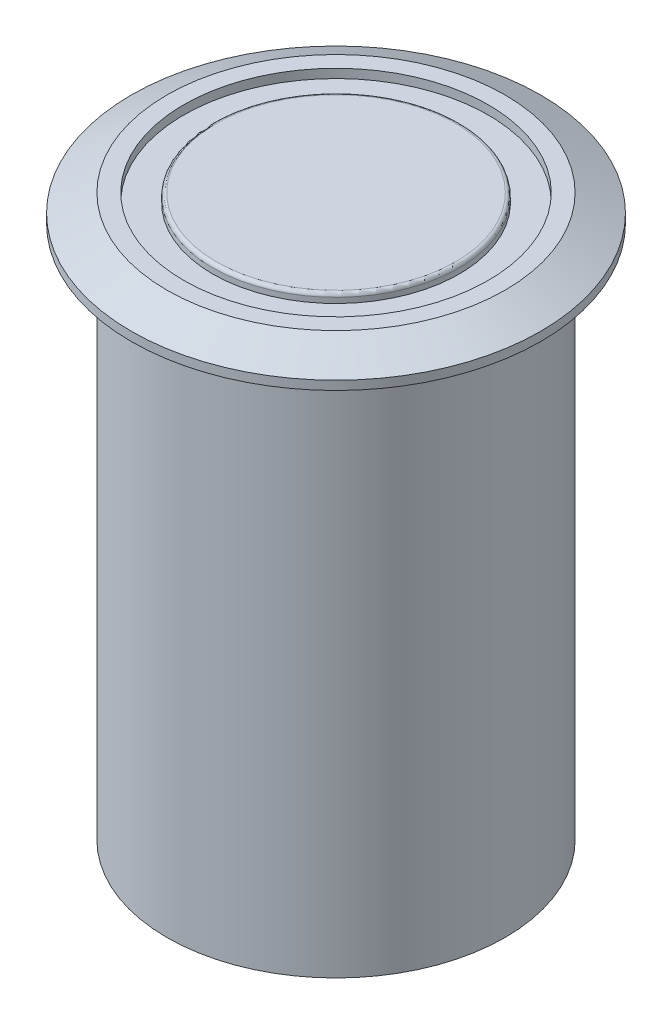
ISO-10303-21;
HEADER;
FILE_DESCRIPTION(('STEP AP214'),'2;1');
FILE_NAME('part.step','',(''),(''),'','','');
FILE_SCHEMA(('AUTOMOTIVE_DESIGN { 1 0 10303 214 1 1 1 1 }'));
ENDSEC;
DATA;
#1=APPLICATION_CONTEXT('core data for automotive mechanical design processes');
#2=APPLICATION_PROTOCOL_DEFINITION('international standard','automotive_design',2000,#1);
#3=PRODUCT_CONTEXT('',#1,'mechanical');
#4=PRODUCT('Part','Part','',(#3));
#5=PRODUCT_RELATED_PRODUCT_CATEGORY('part','',(#4));
#6=PRODUCT_DEFINITION_FORMATION('','',#4);
#7=PRODUCT_DEFINITION_CONTEXT('part definition',#1,'design');
#8=PRODUCT_DEFINITION('design','',#6,#7);
#9=PRODUCT_DEFINITION_SHAPE('','',#8);
#10=(LENGTH_UNIT() NAMED_UNIT(*) SI_UNIT(.MILLI.,.METRE.));
#11=(NAMED_UNIT(*) PLANE_ANGLE_UNIT() SI_UNIT($,.RADIAN.));
#12=(NAMED_UNIT(*) SI_UNIT($,.STERADIAN.) SOLID_ANGLE_UNIT());
#13=UNCERTAINTY_MEASURE_WITH_UNIT(LENGTH_MEASURE(1.E-05),#10,'distance_accuracy_value','');
#14=(GEOMETRIC_REPRESENTATION_CONTEXT(3) GLOBAL_UNCERTAINTY_ASSIGNED_CONTEXT((#13)) GLOBAL_UNIT_ASSIGNED_CONTEXT((#10,
#11,#12)) REPRESENTATION_CONTEXT('',''));
#15=CARTESIAN_POINT('',(0.,0.,0.));
#16=DIRECTION('',(0.,0.,1.));
#17=DIRECTION('',(1.,0.,0.));
#18=AXIS2_PLACEMENT_3D('',#15,#16,#17);
#19=CARTESIAN_POINT('',(0.,30.,0.));
#20=DIRECTION('',(0.,-1.,0.));
#21=DIRECTION('',(0.,0.,-1.));
#22=AXIS2_PLACEMENT_3D('',#19,#20,#21);
#23=CYLINDRICAL_SURFACE('',#22,9.5);
#24=CARTESIAN_POINT('',(0.,30.,0.));
#25=DIRECTION('',(0.,1.,0.));
#26=DIRECTION('',(0.,0.,1.));
#27=AXIS2_PLACEMENT_3D('',#24,#25,#26);
#28=CIRCLE('',#27,9.5);
#29=CARTESIAN_POINT('',(0.,30.,9.5));
#30=VERTEX_POINT('',#29);
#31=EDGE_CURVE('E54',#30,#30,#28,.T.);
#32=ORIENTED_EDGE('',*,*,#31,.F.);
#33=EDGE_LOOP('',(#32));
#34=FACE_BOUND('',#33,.T.);
#35=CARTESIAN_POINT('',(0.,0.,0.));
#36=DIRECTION('',(0.,1.,0.));
#37=DIRECTION('',(0.,0.,1.));
#38=AXIS2_PLACEMENT_3D('',#35,#36,#37);
#39=CIRCLE('',#38,9.5);
#40=CARTESIAN_POINT('',(0.,0.,9.5));
#41=VERTEX_POINT('',#40);
#42=EDGE_CURVE('E55',#41,#41,#39,.T.);
#43=ORIENTED_EDGE('',*,*,#42,.T.);
#44=EDGE_LOOP('',(#43));
#45=FACE_BOUND('',#44,.T.);
#46=ADVANCED_FACE('F34',(#34,#45),#23,.T.);
#47=CARTESIAN_POINT('',(0.,0.,0.));
#48=DIRECTION('',(0.,1.,0.));
#49=DIRECTION('',(0.,0.,1.));
#50=AXIS2_PLACEMENT_3D('',#47,#48,#49);
#51=PLANE('',#50);
#52=ORIENTED_EDGE('',*,*,#42,.F.);
#53=EDGE_LOOP('',(#52));
#54=FACE_BOUND('',#53,.T.);
#55=ADVANCED_FACE('F103',(#54),#51,.F.);
#56=CARTESIAN_POINT('',(0.,30.,0.));
#57=DIRECTION('',(0.,1.,0.));
#58=DIRECTION('',(0.,0.,1.));
#59=AXIS2_PLACEMENT_3D('',#56,#57,#58);
#60=PLANE('',#59);
#61=CARTESIAN_POINT('',(0.,30.,0.));
#62=DIRECTION('',(0.,1.,0.));
#63=DIRECTION('',(0.,0.,1.));
#64=AXIS2_PLACEMENT_3D('',#61,#62,#63);
#65=CIRCLE('',#64,11.5);
#66=CARTESIAN_POINT('',(0.,30.,11.5));
#67=VERTEX_POINT('',#66);
#68=EDGE_CURVE('E58',#67,#67,#65,.T.);
#69=ORIENTED_EDGE('',*,*,#68,.F.);
#70=EDGE_LOOP('',(#69));
#71=FACE_BOUND('',#70,.T.);
#72=ORIENTED_EDGE('',*,*,#31,.T.);
#73=EDGE_LOOP('',(#72));
#74=FACE_BOUND('',#73,.T.);
#75=ADVANCED_FACE('F108',(#71,#74),#60,.F.);
#76=CARTESIAN_POINT('',(0.,31.5,0.));
#77=DIRECTION('',(0.,-1.,0.));
#78=DIRECTION('',(0.,0.,-1.));
#79=AXIS2_PLACEMENT_3D('',#76,#77,#78);
#80=CYLINDRICAL_SURFACE('',#79,11.5);
#81=CARTESIAN_POINT('',(0.,30.5,0.));
#82=DIRECTION('',(0.,1.,0.));
#83=DIRECTION('',(0.,0.,1.));
#84=AXIS2_PLACEMENT_3D('',#81,#82,#83);
#85=CIRCLE('',#84,11.5);
#86=CARTESIAN_POINT('',(0.,30.5,11.5));
#87=VERTEX_POINT('',#86);
#88=EDGE_CURVE('E45',#87,#87,#85,.F.);
#89=ORIENTED_EDGE('',*,*,#88,.T.);
#90=EDGE_LOOP('',(#89));
#91=FACE_BOUND('',#90,.T.);
#92=ORIENTED_EDGE('',*,*,#68,.T.);
#93=EDGE_LOOP('',(#92));
#94=FACE_BOUND('',#93,.T.);
#95=ADVANCED_FACE('F91',(#91,#94),#80,.T.);
#96=CARTESIAN_POINT('',(0.,31.5,0.));
#97=DIRECTION('',(0.,1.,0.));
#98=DIRECTION('',(0.,0.,1.));
#99=AXIS2_PLACEMENT_3D('',#96,#97,#98);
#100=PLANE('',#99);
#101=CARTESIAN_POINT('',(0.,31.5,0.));
#102=DIRECTION('',(0.,1.,0.));
#103=DIRECTION('',(0.,0.,1.));
#104=AXIS2_PLACEMENT_3D('',#101,#102,#103);
#105=CIRCLE('',#104,8.55352361684919);
#106=CARTESIAN_POINT('',(0.,31.5,8.55352361684919));
#107=VERTEX_POINT('',#106);
#108=EDGE_CURVE('E64',#107,#107,#105,.T.);
#109=ORIENTED_EDGE('',*,*,#108,.F.);
#110=EDGE_LOOP('',(#109));
#111=FACE_BOUND('',#110,.T.);
#112=CARTESIAN_POINT('',(0.,31.5,0.));
#113=DIRECTION('',(0.,1.,0.));
#114=DIRECTION('',(0.,0.,1.));
#115=AXIS2_PLACEMENT_3D('',#112,#113,#114);
#116=CIRCLE('',#115,9.49999999999998);
#117=CARTESIAN_POINT('',(0.,31.5,9.49999999999998));
#118=VERTEX_POINT('',#117);
#119=EDGE_CURVE('E49',#118,#118,#116,.T.);
#120=ORIENTED_EDGE('',*,*,#119,.T.);
#121=EDGE_LOOP('',(#120));
#122=FACE_BOUND('',#121,.T.);
#123=ADVANCED_FACE('F88',(#111,#122),#100,.T.);
#124=CARTESIAN_POINT('',(0.,31.5,0.));
#125=DIRECTION('',(0.,-1.,0.));
#126=DIRECTION('',(0.,0.,-1.));
#127=AXIS2_PLACEMENT_3D('',#124,#125,#126);
#128=CONICAL_SURFACE('',#127,9.49999999999998,1.10714871779409);
#129=ORIENTED_EDGE('',*,*,#88,.F.);
#130=EDGE_LOOP('',(#129));
#131=FACE_BOUND('',#130,.T.);
#132=ORIENTED_EDGE('',*,*,#119,.F.);
#133=EDGE_LOOP('',(#132));
#134=FACE_BOUND('',#133,.T.);
#135=ADVANCED_FACE('F84',(#131,#134),#128,.T.);
#136=CARTESIAN_POINT('',(0.,31.,0.));
#137=DIRECTION('',(0.,1.,0.));
#138=DIRECTION('',(0.,0.,1.));
#139=AXIS2_PLACEMENT_3D('',#136,#137,#138);
#140=CYLINDRICAL_SURFACE('',#139,8.55352361684919);
#141=CARTESIAN_POINT('',(0.,31.,0.));
#142=DIRECTION('',(0.,1.,0.));
#143=DIRECTION('',(0.,0.,1.));
#144=AXIS2_PLACEMENT_3D('',#141,#142,#143);
#145=CIRCLE('',#144,8.55352361684919);
#146=CARTESIAN_POINT('',(0.,31.,8.55352361684919));
#147=VERTEX_POINT('',#146);
#148=EDGE_CURVE('E63',#147,#147,#145,.T.);
#149=ORIENTED_EDGE('',*,*,#148,.F.);
#150=EDGE_LOOP('',(#149));
#151=FACE_BOUND('',#150,.T.);
#152=ORIENTED_EDGE('',*,*,#108,.T.);
#153=EDGE_LOOP('',(#152));
#154=FACE_BOUND('',#153,.T.);
#155=ADVANCED_FACE('F78',(#151,#154),#140,.F.);
#156=CARTESIAN_POINT('',(0.,31.,0.));
#157=DIRECTION('',(0.,1.,0.));
#158=DIRECTION('',(0.,0.,1.));
#159=AXIS2_PLACEMENT_3D('',#156,#157,#158);
#160=PLANE('',#159);
#161=CARTESIAN_POINT('',(0.,31.,0.));
#162=DIRECTION('',(0.,1.,0.));
#163=DIRECTION('',(0.,0.,1.));
#164=AXIS2_PLACEMENT_3D('',#161,#162,#163);
#165=CIRCLE('',#164,6.92913885451039);
#166=CARTESIAN_POINT('',(0.,31.,6.92913885451039));
#167=VERTEX_POINT('',#166);
#168=EDGE_CURVE('E67',#167,#167,#165,.T.);
#169=ORIENTED_EDGE('',*,*,#168,.F.);
#170=EDGE_LOOP('',(#169));
#171=FACE_BOUND('',#170,.T.);
#172=ORIENTED_EDGE('',*,*,#148,.T.);
#173=EDGE_LOOP('',(#172));
#174=FACE_BOUND('',#173,.T.);
#175=ADVANCED_FACE('F75',(#171,#174),#160,.T.);
#176=CARTESIAN_POINT('',(0.,31.,0.));
#177=DIRECTION('',(0.,1.,0.));
#178=DIRECTION('',(0.,0.,1.));
#179=AXIS2_PLACEMENT_3D('',#176,#177,#178);
#180=CYLINDRICAL_SURFACE('',#179,6.92913885451039);
#181=CARTESIAN_POINT('',(0.,31.3,0.));
#182=DIRECTION('',(0.,1.,0.));
#183=DIRECTION('',(0.,0.,1.));
#184=AXIS2_PLACEMENT_3D('',#181,#182,#183);
#185=CIRCLE('',#184,6.92913885451039);
#186=CARTESIAN_POINT('',(0.,31.3,6.92913885451039));
#187=VERTEX_POINT('',#186);
#188=EDGE_CURVE('E10',#187,#187,#185,.F.);
#189=ORIENTED_EDGE('',*,*,#188,.T.);
#190=EDGE_LOOP('',(#189));
#191=FACE_BOUND('',#190,.T.);
#192=ORIENTED_EDGE('',*,*,#168,.T.);
#193=EDGE_LOOP('',(#192));
#194=FACE_BOUND('',#193,.T.);
#195=ADVANCED_FACE('F73',(#191,#194),#180,.T.);
#196=CARTESIAN_POINT('',(0.,31.5,0.));
#197=DIRECTION('',(0.,1.,0.));
#198=DIRECTION('',(0.,0.,1.));
#199=AXIS2_PLACEMENT_3D('',#196,#197,#198);
#200=CIRCLE('',#199,6.7291388545104);
#201=CARTESIAN_POINT('',(0.,31.5,6.7291388545104));
#202=VERTEX_POINT('',#201);
#203=EDGE_CURVE('E41',#202,#202,#200,.T.);
#204=ORIENTED_EDGE('',*,*,#203,.T.);
#205=EDGE_LOOP('',(#204));
#206=FACE_BOUND('',#205,.T.);
#207=ADVANCED_FACE('F93',(#206),#100,.T.);
#208=CARTESIAN_POINT('',(0.,31.3,0.));
#209=DIRECTION('',(0.,1.,0.));
#210=DIRECTION('',(0.,0.,1.));
#211=AXIS2_PLACEMENT_3D('',#208,#209,#210);
#212=TOROIDAL_SURFACE('',#211,6.7291388545104,0.2);
#213=ORIENTED_EDGE('',*,*,#188,.F.);
#214=EDGE_LOOP('',(#213));
#215=FACE_BOUND('',#214,.T.);
#216=ORIENTED_EDGE('',*,*,#203,.F.);
#217=EDGE_LOOP('',(#216));
#218=FACE_BOUND('',#217,.T.);
#219=ADVANCED_FACE('F36',(#215,#218),#212,.T.);
#220=CLOSED_SHELL('',(#46,#55,#75,#95,#123,#135,#155,#175,#195,#207,#219));
#221=MANIFOLD_SOLID_BREP('B2',#220);
#222=ADVANCED_BREP_SHAPE_REPRESENTATION('',(#18,#221),#14);
#223=SHAPE_DEFINITION_REPRESENTATION(#9,#222);
ENDSEC;
END-ISO-10303-21;
